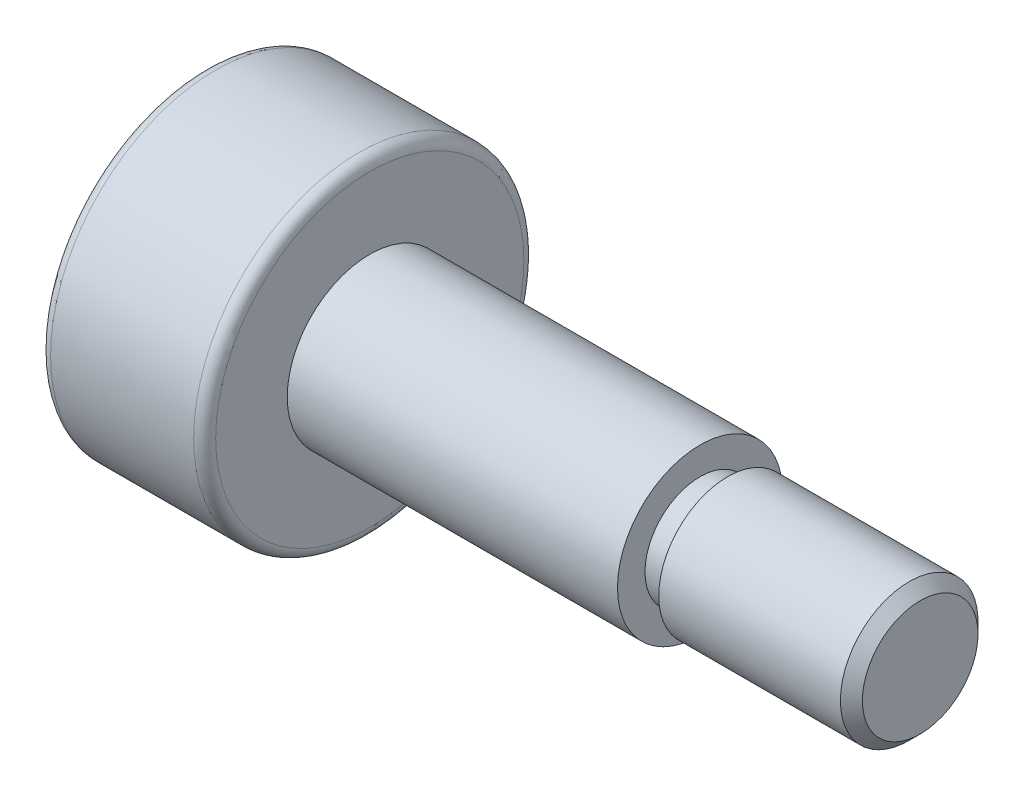
ISO-10303-21;
HEADER;
FILE_DESCRIPTION(('STEP AP214'),'2;1');
FILE_NAME('part.step','',(''),(''),'','','');
FILE_SCHEMA(('AUTOMOTIVE_DESIGN { 1 0 10303 214 1 1 1 1 }'));
ENDSEC;
DATA;
#1=APPLICATION_CONTEXT('core data for automotive mechanical design processes');
#2=APPLICATION_PROTOCOL_DEFINITION('international standard','automotive_design',2000,#1);
#3=PRODUCT_CONTEXT('',#1,'mechanical');
#4=PRODUCT('Part','Part','',(#3));
#5=PRODUCT_RELATED_PRODUCT_CATEGORY('part','',(#4));
#6=PRODUCT_DEFINITION_FORMATION('','',#4);
#7=PRODUCT_DEFINITION_CONTEXT('part definition',#1,'design');
#8=PRODUCT_DEFINITION('design','',#6,#7);
#9=PRODUCT_DEFINITION_SHAPE('','',#8);
#10=(LENGTH_UNIT() NAMED_UNIT(*) SI_UNIT(.MILLI.,.METRE.));
#11=(NAMED_UNIT(*) PLANE_ANGLE_UNIT() SI_UNIT($,.RADIAN.));
#12=(NAMED_UNIT(*) SI_UNIT($,.STERADIAN.) SOLID_ANGLE_UNIT());
#13=UNCERTAINTY_MEASURE_WITH_UNIT(LENGTH_MEASURE(1.E-05),#10,'distance_accuracy_value','');
#14=(GEOMETRIC_REPRESENTATION_CONTEXT(3) GLOBAL_UNCERTAINTY_ASSIGNED_CONTEXT((#13)) GLOBAL_UNIT_ASSIGNED_CONTEXT((#10,
#11,#12)) REPRESENTATION_CONTEXT('',''));
#15=CARTESIAN_POINT('',(0.,0.,0.));
#16=DIRECTION('',(0.,0.,1.));
#17=DIRECTION('',(1.,0.,0.));
#18=AXIS2_PLACEMENT_3D('',#15,#16,#17);
#19=CARTESIAN_POINT('',(-6.5,0.,0.));
#20=DIRECTION('',(1.,0.,0.));
#21=DIRECTION('',(0.,0.,-1.));
#22=AXIS2_PLACEMENT_3D('',#19,#20,#21);
#23=PLANE('',#22);
#24=DIRECTION('',(0.,0.866025403784438,-0.5));
#25=VECTOR('',#24,1.);
#26=CARTESIAN_POINT('',(-6.5,0.,1.73205080756888));
#27=LINE('',#26,#25);
#28=CARTESIAN_POINT('',(-6.5,0.,1.73205080756888));
#29=VERTEX_POINT('',#28);
#30=CARTESIAN_POINT('',(-6.5,1.5,0.866025403784438));
#31=VERTEX_POINT('',#30);
#32=EDGE_CURVE('E125',#29,#31,#27,.T.);
#33=ORIENTED_EDGE('',*,*,#32,.F.);
#34=DIRECTION('',(0.,0.866025403784439,0.5));
#35=VECTOR('',#34,1.);
#36=CARTESIAN_POINT('',(-6.5,-1.5,0.866025403784438));
#37=LINE('',#36,#35);
#38=CARTESIAN_POINT('',(-6.5,-1.5,0.866025403784438));
#39=VERTEX_POINT('',#38);
#40=EDGE_CURVE('E51',#39,#29,#37,.T.);
#41=ORIENTED_EDGE('',*,*,#40,.F.);
#42=DIRECTION('',(0.,0.,1.));
#43=VECTOR('',#42,1.);
#44=CARTESIAN_POINT('',(-6.5,-1.5,-0.866025403784438));
#45=LINE('',#44,#43);
#46=CARTESIAN_POINT('',(-6.5,-1.5,-0.866025403784438));
#47=VERTEX_POINT('',#46);
#48=EDGE_CURVE('E134',#47,#39,#45,.T.);
#49=ORIENTED_EDGE('',*,*,#48,.F.);
#50=DIRECTION('',(0.,-0.866025403784438,0.5));
#51=VECTOR('',#50,1.);
#52=CARTESIAN_POINT('',(-6.5,0.,-1.73205080756888));
#53=LINE('',#52,#51);
#54=CARTESIAN_POINT('',(-6.5,0.,-1.73205080756888));
#55=VERTEX_POINT('',#54);
#56=EDGE_CURVE('E132',#55,#47,#53,.T.);
#57=ORIENTED_EDGE('',*,*,#56,.F.);
#58=DIRECTION('',(0.,-0.866025403784439,-0.5));
#59=VECTOR('',#58,1.);
#60=CARTESIAN_POINT('',(-6.5,1.5,-0.866025403784438));
#61=LINE('',#60,#59);
#62=CARTESIAN_POINT('',(-6.5,1.5,-0.866025403784438));
#63=VERTEX_POINT('',#62);
#64=EDGE_CURVE('E99',#63,#55,#61,.T.);
#65=ORIENTED_EDGE('',*,*,#64,.F.);
#66=DIRECTION('',(0.,0.,-1.));
#67=VECTOR('',#66,1.);
#68=CARTESIAN_POINT('',(-6.5,1.5,0.866025403784438));
#69=LINE('',#68,#67);
#70=EDGE_CURVE('E128',#31,#63,#69,.T.);
#71=ORIENTED_EDGE('',*,*,#70,.F.);
#72=EDGE_LOOP('',(#33,#41,#49,#57,#65,#71));
#73=FACE_BOUND('',#72,.T.);
#74=CARTESIAN_POINT('',(-6.5,0.,0.));
#75=DIRECTION('',(1.,0.,0.));
#76=DIRECTION('',(0.,0.,-1.));
#77=AXIS2_PLACEMENT_3D('',#74,#75,#76);
#78=CIRCLE('',#77,2.8);
#79=CARTESIAN_POINT('',(-6.5,0.,-2.8));
#80=VERTEX_POINT('',#79);
#81=EDGE_CURVE('E167',#80,#80,#78,.F.);
#82=ORIENTED_EDGE('',*,*,#81,.T.);
#83=EDGE_LOOP('',(#82));
#84=FACE_BOUND('',#83,.T.);
#85=ADVANCED_FACE('F35',(#73,#84),#23,.F.);
#86=CARTESIAN_POINT('',(-6.5,0.,0.));
#87=DIRECTION('',(-1.,0.,0.));
#88=DIRECTION('',(0.,0.,1.));
#89=AXIS2_PLACEMENT_3D('',#86,#87,#88);
#90=CYLINDRICAL_SURFACE('',#89,3.);
#91=CARTESIAN_POINT('',(-3.7,0.,0.));
#92=DIRECTION('',(-1.,0.,0.));
#93=DIRECTION('',(0.,0.,1.));
#94=AXIS2_PLACEMENT_3D('',#91,#92,#93);
#95=CIRCLE('',#94,3.);
#96=CARTESIAN_POINT('',(-3.7,0.,3.));
#97=VERTEX_POINT('',#96);
#98=EDGE_CURVE('E161',#97,#97,#95,.T.);
#99=ORIENTED_EDGE('',*,*,#98,.T.);
#100=EDGE_LOOP('',(#99));
#101=FACE_BOUND('',#100,.T.);
#102=CARTESIAN_POINT('',(-6.3,0.,0.));
#103=DIRECTION('',(1.,0.,0.));
#104=DIRECTION('',(0.,0.,-1.));
#105=AXIS2_PLACEMENT_3D('',#102,#103,#104);
#106=CIRCLE('',#105,3.);
#107=CARTESIAN_POINT('',(-6.3,0.,-3.));
#108=VERTEX_POINT('',#107);
#109=EDGE_CURVE('E158',#108,#108,#106,.T.);
#110=ORIENTED_EDGE('',*,*,#109,.T.);
#111=EDGE_LOOP('',(#110));
#112=FACE_BOUND('',#111,.T.);
#113=ADVANCED_FACE('F191',(#101,#112),#90,.T.);
#114=CARTESIAN_POINT('',(-3.5,3.,0.));
#115=DIRECTION('',(-1.,0.,0.));
#116=DIRECTION('',(0.,0.,1.));
#117=AXIS2_PLACEMENT_3D('',#114,#115,#116);
#118=PLANE('',#117);
#119=CARTESIAN_POINT('',(-3.5,0.,0.));
#120=DIRECTION('',(-1.,0.,0.));
#121=DIRECTION('',(0.,0.,1.));
#122=AXIS2_PLACEMENT_3D('',#119,#120,#121);
#123=CIRCLE('',#122,2.8);
#124=CARTESIAN_POINT('',(-3.5,0.,2.8));
#125=VERTEX_POINT('',#124);
#126=EDGE_CURVE('E164',#125,#125,#123,.F.);
#127=ORIENTED_EDGE('',*,*,#126,.T.);
#128=EDGE_LOOP('',(#127));
#129=FACE_BOUND('',#128,.T.);
#130=CARTESIAN_POINT('',(-3.5,0.,0.));
#131=DIRECTION('',(-1.,0.,0.));
#132=DIRECTION('',(0.,0.,1.));
#133=AXIS2_PLACEMENT_3D('',#130,#131,#132);
#134=CIRCLE('',#133,1.5);
#135=CARTESIAN_POINT('',(-3.5,0.,1.5));
#136=VERTEX_POINT('',#135);
#137=EDGE_CURVE('E155',#136,#136,#134,.T.);
#138=ORIENTED_EDGE('',*,*,#137,.T.);
#139=EDGE_LOOP('',(#138));
#140=FACE_BOUND('',#139,.T.);
#141=ADVANCED_FACE('F198',(#129,#140),#118,.F.);
#142=CARTESIAN_POINT('',(-6.5,0.,0.));
#143=DIRECTION('',(-1.,0.,0.));
#144=DIRECTION('',(0.,0.,1.));
#145=AXIS2_PLACEMENT_3D('',#142,#143,#144);
#146=CYLINDRICAL_SURFACE('',#145,1.5);
#147=ORIENTED_EDGE('',*,*,#137,.F.);
#148=EDGE_LOOP('',(#147));
#149=FACE_BOUND('',#148,.T.);
#150=CARTESIAN_POINT('',(2.5,0.,0.));
#151=DIRECTION('',(-1.,0.,0.));
#152=DIRECTION('',(0.,0.,1.));
#153=AXIS2_PLACEMENT_3D('',#150,#151,#152);
#154=CIRCLE('',#153,1.5);
#155=CARTESIAN_POINT('',(2.5,0.,1.5));
#156=VERTEX_POINT('',#155);
#157=EDGE_CURVE('E152',#156,#156,#154,.T.);
#158=ORIENTED_EDGE('',*,*,#157,.T.);
#159=EDGE_LOOP('',(#158));
#160=FACE_BOUND('',#159,.T.);
#161=ADVANCED_FACE('F231',(#149,#160),#146,.T.);
#162=CARTESIAN_POINT('',(2.5,1.5,0.));
#163=DIRECTION('',(-1.,0.,0.));
#164=DIRECTION('',(0.,0.,1.));
#165=AXIS2_PLACEMENT_3D('',#162,#163,#164);
#166=PLANE('',#165);
#167=ORIENTED_EDGE('',*,*,#157,.F.);
#168=EDGE_LOOP('',(#167));
#169=FACE_BOUND('',#168,.T.);
#170=CARTESIAN_POINT('',(2.5,0.,0.));
#171=DIRECTION('',(-1.,0.,0.));
#172=DIRECTION('',(0.,0.,1.));
#173=AXIS2_PLACEMENT_3D('',#170,#171,#172);
#174=CIRCLE('',#173,1.);
#175=CARTESIAN_POINT('',(2.5,0.,1.));
#176=VERTEX_POINT('',#175);
#177=EDGE_CURVE('E149',#176,#176,#174,.T.);
#178=ORIENTED_EDGE('',*,*,#177,.T.);
#179=EDGE_LOOP('',(#178));
#180=FACE_BOUND('',#179,.T.);
#181=ADVANCED_FACE('F208',(#169,#180),#166,.F.);
#182=CARTESIAN_POINT('',(-3.7,0.,0.));
#183=DIRECTION('',(-1.,0.,0.));
#184=DIRECTION('',(0.,0.,1.));
#185=AXIS2_PLACEMENT_3D('',#182,#183,#184);
#186=TOROIDAL_SURFACE('',#185,2.8,0.2);
#187=ORIENTED_EDGE('',*,*,#126,.F.);
#188=EDGE_LOOP('',(#187));
#189=FACE_BOUND('',#188,.T.);
#190=ORIENTED_EDGE('',*,*,#98,.F.);
#191=EDGE_LOOP('',(#190));
#192=FACE_BOUND('',#191,.T.);
#193=ADVANCED_FACE('F205',(#189,#192),#186,.T.);
#194=CARTESIAN_POINT('',(-6.3,0.,0.));
#195=DIRECTION('',(1.,0.,0.));
#196=DIRECTION('',(0.,0.,-1.));
#197=AXIS2_PLACEMENT_3D('',#194,#195,#196);
#198=TOROIDAL_SURFACE('',#197,2.8,0.2);
#199=ORIENTED_EDGE('',*,*,#109,.F.);
#200=EDGE_LOOP('',(#199));
#201=FACE_BOUND('',#200,.T.);
#202=ORIENTED_EDGE('',*,*,#81,.F.);
#203=EDGE_LOOP('',(#202));
#204=FACE_BOUND('',#203,.T.);
#205=ADVANCED_FACE('F207',(#201,#204),#198,.T.);
#206=CARTESIAN_POINT('',(2.5,0.,0.));
#207=DIRECTION('',(-1.,0.,0.));
#208=DIRECTION('',(0.,0.,1.));
#209=AXIS2_PLACEMENT_3D('',#206,#207,#208);
#210=CYLINDRICAL_SURFACE('',#209,1.);
#211=CARTESIAN_POINT('',(3.,0.,0.));
#212=DIRECTION('',(-1.,0.,0.));
#213=DIRECTION('',(0.,0.,1.));
#214=AXIS2_PLACEMENT_3D('',#211,#212,#213);
#215=CIRCLE('',#214,1.);
#216=CARTESIAN_POINT('',(3.,0.,1.));
#217=VERTEX_POINT('',#216);
#218=EDGE_CURVE('E146',#217,#217,#215,.T.);
#219=ORIENTED_EDGE('',*,*,#218,.T.);
#220=EDGE_LOOP('',(#219));
#221=FACE_BOUND('',#220,.T.);
#222=ORIENTED_EDGE('',*,*,#177,.F.);
#223=EDGE_LOOP('',(#222));
#224=FACE_BOUND('',#223,.T.);
#225=ADVANCED_FACE('F211',(#221,#224),#210,.T.);
#226=CARTESIAN_POINT('',(3.,1.25,0.));
#227=DIRECTION('',(-1.,0.,0.));
#228=DIRECTION('',(0.,0.,1.));
#229=AXIS2_PLACEMENT_3D('',#226,#227,#228);
#230=PLANE('',#229);
#231=CARTESIAN_POINT('',(3.,0.,0.));
#232=DIRECTION('',(-1.,0.,0.));
#233=DIRECTION('',(0.,0.,1.));
#234=AXIS2_PLACEMENT_3D('',#231,#232,#233);
#235=CIRCLE('',#234,1.25);
#236=CARTESIAN_POINT('',(3.,0.,1.25));
#237=VERTEX_POINT('',#236);
#238=EDGE_CURVE('E138',#237,#237,#235,.T.);
#239=ORIENTED_EDGE('',*,*,#238,.T.);
#240=EDGE_LOOP('',(#239));
#241=FACE_BOUND('',#240,.T.);
#242=ORIENTED_EDGE('',*,*,#218,.F.);
#243=EDGE_LOOP('',(#242));
#244=FACE_BOUND('',#243,.T.);
#245=ADVANCED_FACE('F186',(#241,#244),#230,.T.);
#246=CARTESIAN_POINT('',(6.5,1.25,0.));
#247=DIRECTION('',(-1.,0.,0.));
#248=DIRECTION('',(0.,0.,1.));
#249=AXIS2_PLACEMENT_3D('',#246,#247,#248);
#250=PLANE('',#249);
#251=CARTESIAN_POINT('',(6.5,0.,0.));
#252=DIRECTION('',(-1.,0.,0.));
#253=DIRECTION('',(0.,0.,1.));
#254=AXIS2_PLACEMENT_3D('',#251,#252,#253);
#255=CIRCLE('',#254,1.05);
#256=CARTESIAN_POINT('',(6.5,0.,1.05));
#257=VERTEX_POINT('',#256);
#258=EDGE_CURVE('E11',#257,#257,#255,.F.);
#259=ORIENTED_EDGE('',*,*,#258,.T.);
#260=EDGE_LOOP('',(#259));
#261=FACE_BOUND('',#260,.T.);
#262=ADVANCED_FACE('F176',(#261),#250,.F.);
#263=CARTESIAN_POINT('',(6.3,0.,0.));
#264=DIRECTION('',(-1.,0.,0.));
#265=DIRECTION('',(0.,0.,1.));
#266=AXIS2_PLACEMENT_3D('',#263,#264,#265);
#267=CONICAL_SURFACE('',#266,1.25,0.785398163397454);
#268=ORIENTED_EDGE('',*,*,#258,.F.);
#269=EDGE_LOOP('',(#268));
#270=FACE_BOUND('',#269,.T.);
#271=CARTESIAN_POINT('',(6.3,0.,0.));
#272=DIRECTION('',(-1.,0.,0.));
#273=DIRECTION('',(0.,0.,1.));
#274=AXIS2_PLACEMENT_3D('',#271,#272,#273);
#275=CIRCLE('',#274,1.25);
#276=CARTESIAN_POINT('',(6.3,0.,1.25));
#277=VERTEX_POINT('',#276);
#278=EDGE_CURVE('E44',#277,#277,#275,.T.);
#279=ORIENTED_EDGE('',*,*,#278,.F.);
#280=EDGE_LOOP('',(#279));
#281=FACE_BOUND('',#280,.T.);
#282=ADVANCED_FACE('F38',(#270,#281),#267,.T.);
#283=CARTESIAN_POINT('',(-6.5,0.,0.));
#284=DIRECTION('',(-1.,0.,0.));
#285=DIRECTION('',(0.,0.,1.));
#286=AXIS2_PLACEMENT_3D('',#283,#284,#285);
#287=CYLINDRICAL_SURFACE('',#286,1.25);
#288=ORIENTED_EDGE('',*,*,#278,.T.);
#289=EDGE_LOOP('',(#288));
#290=FACE_BOUND('',#289,.T.);
#291=ORIENTED_EDGE('',*,*,#238,.F.);
#292=EDGE_LOOP('',(#291));
#293=FACE_BOUND('',#292,.T.);
#294=ADVANCED_FACE('F172',(#290,#293),#287,.T.);
#295=CARTESIAN_POINT('',(-4.5,-1.5,0.866025403784438));
#296=DIRECTION('',(0.,-0.5,0.866025403784439));
#297=DIRECTION('',(0.,-0.866025403784439,-0.5));
#298=AXIS2_PLACEMENT_3D('',#295,#296,#297);
#299=PLANE('',#298);
#300=ORIENTED_EDGE('',*,*,#40,.T.);
#301=DIRECTION('',(-1.,0.,0.));
#302=VECTOR('',#301,1.);
#303=CARTESIAN_POINT('',(-4.5,0.,1.73205080756888));
#304=LINE('',#303,#302);
#305=CARTESIAN_POINT('',(-4.5,0.,1.73205080756888));
#306=VERTEX_POINT('',#305);
#307=EDGE_CURVE('E81',#306,#29,#304,.T.);
#308=ORIENTED_EDGE('',*,*,#307,.F.);
#309=DIRECTION('',(0.,0.866025403784439,0.5));
#310=VECTOR('',#309,1.);
#311=CARTESIAN_POINT('',(-4.5,-1.5,0.866025403784438));
#312=LINE('',#311,#310);
#313=CARTESIAN_POINT('',(-4.5,-1.5,0.866025403784438));
#314=VERTEX_POINT('',#313);
#315=EDGE_CURVE('E136',#314,#306,#312,.T.);
#316=ORIENTED_EDGE('',*,*,#315,.F.);
#317=DIRECTION('',(-1.,0.,0.));
#318=VECTOR('',#317,1.);
#319=CARTESIAN_POINT('',(-4.5,-1.5,0.866025403784438));
#320=LINE('',#319,#318);
#321=EDGE_CURVE('E59',#314,#39,#320,.T.);
#322=ORIENTED_EDGE('',*,*,#321,.T.);
#323=EDGE_LOOP('',(#300,#308,#316,#322));
#324=FACE_BOUND('',#323,.T.);
#325=ADVANCED_FACE('F183',(#324),#299,.F.);
#326=CARTESIAN_POINT('',(-4.5,-1.5,-0.866025403784438));
#327=DIRECTION('',(0.,-1.,0.));
#328=DIRECTION('',(0.,0.,-1.));
#329=AXIS2_PLACEMENT_3D('',#326,#327,#328);
#330=PLANE('',#329);
#331=ORIENTED_EDGE('',*,*,#48,.T.);
#332=ORIENTED_EDGE('',*,*,#321,.F.);
#333=DIRECTION('',(0.,0.,1.));
#334=VECTOR('',#333,1.);
#335=CARTESIAN_POINT('',(-4.5,-1.5,-0.866025403784438));
#336=LINE('',#335,#334);
#337=CARTESIAN_POINT('',(-4.5,-1.5,-0.866025403784438));
#338=VERTEX_POINT('',#337);
#339=EDGE_CURVE('E111',#338,#314,#336,.T.);
#340=ORIENTED_EDGE('',*,*,#339,.F.);
#341=DIRECTION('',(-1.,0.,0.));
#342=VECTOR('',#341,1.);
#343=CARTESIAN_POINT('',(-4.5,-1.5,-0.866025403784438));
#344=LINE('',#343,#342);
#345=EDGE_CURVE('E103',#338,#47,#344,.T.);
#346=ORIENTED_EDGE('',*,*,#345,.T.);
#347=EDGE_LOOP('',(#331,#332,#340,#346));
#348=FACE_BOUND('',#347,.T.);
#349=ADVANCED_FACE('F298',(#348),#330,.F.);
#350=CARTESIAN_POINT('',(-4.5,0.,-1.73205080756888));
#351=DIRECTION('',(0.,-0.5,-0.866025403784438));
#352=DIRECTION('',(0.,0.866025403784439,-0.5));
#353=AXIS2_PLACEMENT_3D('',#350,#351,#352);
#354=PLANE('',#353);
#355=ORIENTED_EDGE('',*,*,#56,.T.);
#356=ORIENTED_EDGE('',*,*,#345,.F.);
#357=DIRECTION('',(0.,-0.866025403784438,0.5));
#358=VECTOR('',#357,1.);
#359=CARTESIAN_POINT('',(-4.5,0.,-1.73205080756888));
#360=LINE('',#359,#358);
#361=CARTESIAN_POINT('',(-4.5,0.,-1.73205080756888));
#362=VERTEX_POINT('',#361);
#363=EDGE_CURVE('E107',#362,#338,#360,.T.);
#364=ORIENTED_EDGE('',*,*,#363,.F.);
#365=DIRECTION('',(-1.,0.,0.));
#366=VECTOR('',#365,1.);
#367=CARTESIAN_POINT('',(-4.5,0.,-1.73205080756888));
#368=LINE('',#367,#366);
#369=EDGE_CURVE('E92',#362,#55,#368,.T.);
#370=ORIENTED_EDGE('',*,*,#369,.T.);
#371=EDGE_LOOP('',(#355,#356,#364,#370));
#372=FACE_BOUND('',#371,.T.);
#373=ADVANCED_FACE('F108',(#372),#354,.F.);
#374=CARTESIAN_POINT('',(-4.5,1.5,-0.866025403784438));
#375=DIRECTION('',(0.,0.5,-0.866025403784439));
#376=DIRECTION('',(0.,0.866025403784439,0.5));
#377=AXIS2_PLACEMENT_3D('',#374,#375,#376);
#378=PLANE('',#377);
#379=ORIENTED_EDGE('',*,*,#64,.T.);
#380=ORIENTED_EDGE('',*,*,#369,.F.);
#381=DIRECTION('',(0.,-0.866025403784439,-0.5));
#382=VECTOR('',#381,1.);
#383=CARTESIAN_POINT('',(-4.5,1.5,-0.866025403784438));
#384=LINE('',#383,#382);
#385=CARTESIAN_POINT('',(-4.5,1.5,-0.866025403784438));
#386=VERTEX_POINT('',#385);
#387=EDGE_CURVE('E96',#386,#362,#384,.T.);
#388=ORIENTED_EDGE('',*,*,#387,.F.);
#389=DIRECTION('',(-1.,0.,0.));
#390=VECTOR('',#389,1.);
#391=CARTESIAN_POINT('',(-4.5,1.5,-0.866025403784438));
#392=LINE('',#391,#390);
#393=EDGE_CURVE('E104',#386,#63,#392,.T.);
#394=ORIENTED_EDGE('',*,*,#393,.T.);
#395=EDGE_LOOP('',(#379,#380,#388,#394));
#396=FACE_BOUND('',#395,.T.);
#397=ADVANCED_FACE('F94',(#396),#378,.F.);
#398=CARTESIAN_POINT('',(-4.5,1.5,0.866025403784438));
#399=DIRECTION('',(0.,1.,0.));
#400=DIRECTION('',(0.,0.,1.));
#401=AXIS2_PLACEMENT_3D('',#398,#399,#400);
#402=PLANE('',#401);
#403=ORIENTED_EDGE('',*,*,#70,.T.);
#404=ORIENTED_EDGE('',*,*,#393,.F.);
#405=DIRECTION('',(0.,0.,-1.));
#406=VECTOR('',#405,1.);
#407=CARTESIAN_POINT('',(-4.5,1.5,0.866025403784438));
#408=LINE('',#407,#406);
#409=CARTESIAN_POINT('',(-4.5,1.5,0.866025403784438));
#410=VERTEX_POINT('',#409);
#411=EDGE_CURVE('E117',#410,#386,#408,.T.);
#412=ORIENTED_EDGE('',*,*,#411,.F.);
#413=DIRECTION('',(-1.,0.,0.));
#414=VECTOR('',#413,1.);
#415=CARTESIAN_POINT('',(-4.5,1.5,0.866025403784438));
#416=LINE('',#415,#414);
#417=EDGE_CURVE('E141',#410,#31,#416,.T.);
#418=ORIENTED_EDGE('',*,*,#417,.T.);
#419=EDGE_LOOP('',(#403,#404,#412,#418));
#420=FACE_BOUND('',#419,.T.);
#421=ADVANCED_FACE('F319',(#420),#402,.F.);
#422=CARTESIAN_POINT('',(-4.5,0.,1.73205080756888));
#423=DIRECTION('',(0.,0.5,0.866025403784438));
#424=DIRECTION('',(0.,-0.866025403784439,0.5));
#425=AXIS2_PLACEMENT_3D('',#422,#423,#424);
#426=PLANE('',#425);
#427=ORIENTED_EDGE('',*,*,#32,.T.);
#428=ORIENTED_EDGE('',*,*,#417,.F.);
#429=DIRECTION('',(0.,0.866025403784438,-0.5));
#430=VECTOR('',#429,1.);
#431=CARTESIAN_POINT('',(-4.5,0.,1.73205080756888));
#432=LINE('',#431,#430);
#433=EDGE_CURVE('E119',#306,#410,#432,.T.);
#434=ORIENTED_EDGE('',*,*,#433,.F.);
#435=ORIENTED_EDGE('',*,*,#307,.T.);
#436=EDGE_LOOP('',(#427,#428,#434,#435));
#437=FACE_BOUND('',#436,.T.);
#438=ADVANCED_FACE('F327',(#437),#426,.F.);
#439=CARTESIAN_POINT('',(-4.5,0.,0.));
#440=DIRECTION('',(-1.,0.,0.));
#441=DIRECTION('',(0.,0.,1.));
#442=AXIS2_PLACEMENT_3D('',#439,#440,#441);
#443=PLANE('',#442);
#444=ORIENTED_EDGE('',*,*,#315,.T.);
#445=ORIENTED_EDGE('',*,*,#433,.T.);
#446=ORIENTED_EDGE('',*,*,#411,.T.);
#447=ORIENTED_EDGE('',*,*,#387,.T.);
#448=ORIENTED_EDGE('',*,*,#363,.T.);
#449=ORIENTED_EDGE('',*,*,#339,.T.);
#450=EDGE_LOOP('',(#444,#445,#446,#447,#448,#449));
#451=FACE_BOUND('',#450,.T.);
#452=ADVANCED_FACE('F114',(#451),#443,.T.);
#453=CLOSED_SHELL('',(#85,#113,#141,#161,#181,#193,#205,#225,#245,#262,#282,#294,#325,#349,#373,
#397,#421,#438,#452));
#454=MANIFOLD_SOLID_BREP('B2',#453);
#455=ADVANCED_BREP_SHAPE_REPRESENTATION('',(#18,#454),#14);
#456=SHAPE_DEFINITION_REPRESENTATION(#9,#455);
ENDSEC;
END-ISO-10303-21;
